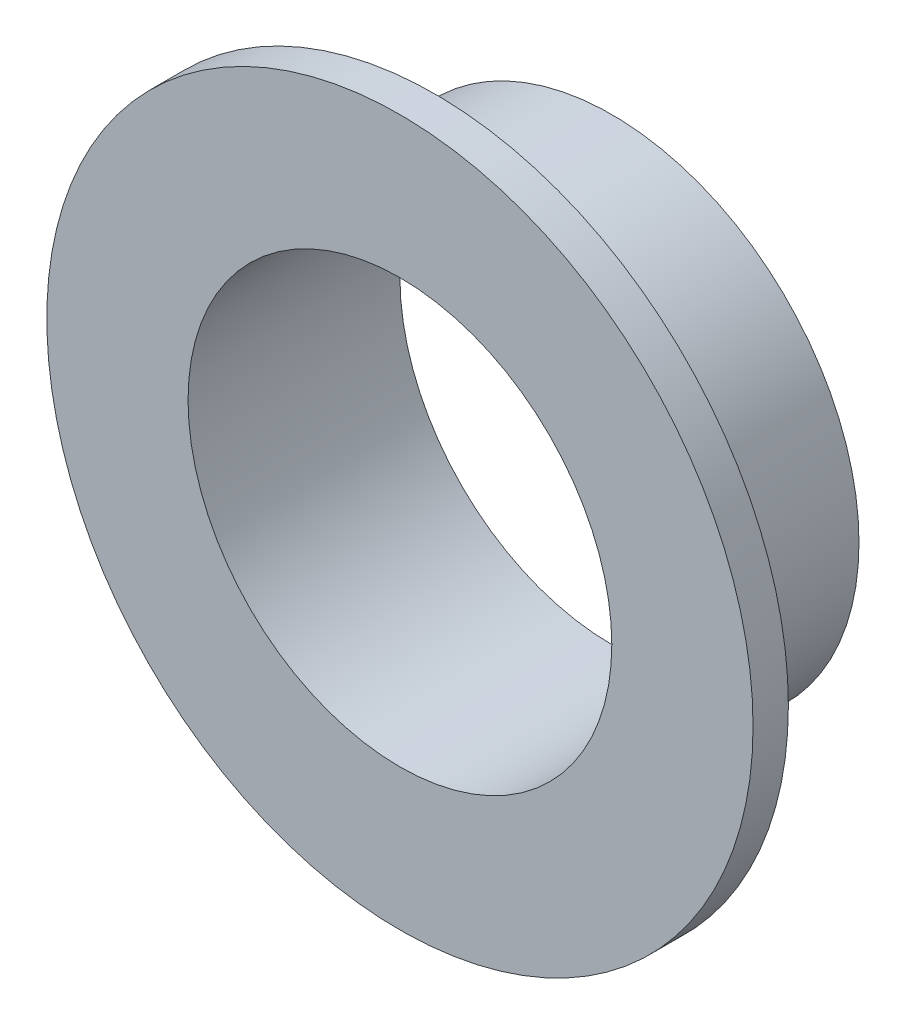
ISO-10303-21;
HEADER;
FILE_DESCRIPTION(('STEP AP214'),'2;1');
FILE_NAME('part.step','',(''),(''),'','','');
FILE_SCHEMA(('AUTOMOTIVE_DESIGN { 1 0 10303 214 1 1 1 1 }'));
ENDSEC;
DATA;
#1=APPLICATION_CONTEXT('core data for automotive mechanical design processes');
#2=APPLICATION_PROTOCOL_DEFINITION('international standard','automotive_design',2000,#1);
#3=PRODUCT_CONTEXT('',#1,'mechanical');
#4=PRODUCT('Part','Part','',(#3));
#5=PRODUCT_RELATED_PRODUCT_CATEGORY('part','',(#4));
#6=PRODUCT_DEFINITION_FORMATION('','',#4);
#7=PRODUCT_DEFINITION_CONTEXT('part definition',#1,'design');
#8=PRODUCT_DEFINITION('design','',#6,#7);
#9=PRODUCT_DEFINITION_SHAPE('','',#8);
#10=(LENGTH_UNIT() NAMED_UNIT(*) SI_UNIT(.MILLI.,.METRE.));
#11=(NAMED_UNIT(*) PLANE_ANGLE_UNIT() SI_UNIT($,.RADIAN.));
#12=(NAMED_UNIT(*) SI_UNIT($,.STERADIAN.) SOLID_ANGLE_UNIT());
#13=UNCERTAINTY_MEASURE_WITH_UNIT(LENGTH_MEASURE(1.E-05),#10,'distance_accuracy_value','');
#14=(GEOMETRIC_REPRESENTATION_CONTEXT(3) GLOBAL_UNCERTAINTY_ASSIGNED_CONTEXT((#13)) GLOBAL_UNIT_ASSIGNED_CONTEXT((#10,
#11,#12)) REPRESENTATION_CONTEXT('',''));
#15=CARTESIAN_POINT('',(0.,0.,0.));
#16=DIRECTION('',(0.,0.,1.));
#17=DIRECTION('',(1.,0.,0.));
#18=AXIS2_PLACEMENT_3D('',#15,#16,#17);
#19=CARTESIAN_POINT('',(0.,0.,0.));
#20=DIRECTION('',(0.,0.,1.));
#21=DIRECTION('',(1.,0.,0.));
#22=AXIS2_PLACEMENT_3D('',#19,#20,#21);
#23=PLANE('',#22);
#24=CARTESIAN_POINT('',(0.,0.,0.));
#25=DIRECTION('',(0.,0.,1.));
#26=DIRECTION('',(1.,0.,0.));
#27=AXIS2_PLACEMENT_3D('',#24,#25,#26);
#28=CIRCLE('',#27,7.);
#29=CARTESIAN_POINT('',(7.,0.,0.));
#30=VERTEX_POINT('',#29);
#31=EDGE_CURVE('E41',#30,#30,#28,.T.);
#32=ORIENTED_EDGE('',*,*,#31,.F.);
#33=EDGE_LOOP('',(#32));
#34=FACE_BOUND('',#33,.T.);
#35=CARTESIAN_POINT('',(0.,0.,0.));
#36=DIRECTION('',(0.,0.,1.));
#37=DIRECTION('',(1.,0.,0.));
#38=AXIS2_PLACEMENT_3D('',#35,#36,#37);
#39=CIRCLE('',#38,6.);
#40=CARTESIAN_POINT('',(6.,0.,0.));
#41=VERTEX_POINT('',#40);
#42=EDGE_CURVE('E48',#41,#41,#39,.T.);
#43=ORIENTED_EDGE('',*,*,#42,.T.);
#44=EDGE_LOOP('',(#43));
#45=FACE_BOUND('',#44,.T.);
#46=ADVANCED_FACE('F40',(#34,#45),#23,.F.);
#47=CARTESIAN_POINT('',(0.,0.,5.));
#48=DIRECTION('',(0.,0.,-1.));
#49=DIRECTION('',(-1.,0.,0.));
#50=AXIS2_PLACEMENT_3D('',#47,#48,#49);
#51=CYLINDRICAL_SURFACE('',#50,7.);
#52=CARTESIAN_POINT('',(0.,0.,5.));
#53=DIRECTION('',(0.,0.,1.));
#54=DIRECTION('',(1.,0.,0.));
#55=AXIS2_PLACEMENT_3D('',#52,#53,#54);
#56=CIRCLE('',#55,7.);
#57=CARTESIAN_POINT('',(7.,0.,5.));
#58=VERTEX_POINT('',#57);
#59=EDGE_CURVE('E10',#58,#58,#56,.T.);
#60=ORIENTED_EDGE('',*,*,#59,.F.);
#61=EDGE_LOOP('',(#60));
#62=FACE_BOUND('',#61,.T.);
#63=ORIENTED_EDGE('',*,*,#31,.T.);
#64=EDGE_LOOP('',(#63));
#65=FACE_BOUND('',#64,.T.);
#66=ADVANCED_FACE('F39',(#62,#65),#51,.T.);
#67=CARTESIAN_POINT('',(0.,0.,5.));
#68=DIRECTION('',(0.,0.,-1.));
#69=DIRECTION('',(-1.,0.,0.));
#70=AXIS2_PLACEMENT_3D('',#67,#68,#69);
#71=CYLINDRICAL_SURFACE('',#70,6.);
#72=ORIENTED_EDGE('',*,*,#42,.F.);
#73=EDGE_LOOP('',(#72));
#74=FACE_BOUND('',#73,.T.);
#75=CARTESIAN_POINT('',(0.,0.,6.));
#76=DIRECTION('',(0.,0.,1.));
#77=DIRECTION('',(1.,0.,0.));
#78=AXIS2_PLACEMENT_3D('',#75,#76,#77);
#79=CIRCLE('',#78,6.);
#80=CARTESIAN_POINT('',(6.,0.,6.));
#81=VERTEX_POINT('',#80);
#82=EDGE_CURVE('E57',#81,#81,#79,.T.);
#83=ORIENTED_EDGE('',*,*,#82,.T.);
#84=EDGE_LOOP('',(#83));
#85=FACE_BOUND('',#84,.T.);
#86=ADVANCED_FACE('F64',(#74,#85),#71,.F.);
#87=CARTESIAN_POINT('',(0.,0.,6.));
#88=DIRECTION('',(0.,0.,1.));
#89=DIRECTION('',(1.,0.,0.));
#90=AXIS2_PLACEMENT_3D('',#87,#88,#89);
#91=PLANE('',#90);
#92=CARTESIAN_POINT('',(0.,0.,6.));
#93=DIRECTION('',(0.,0.,1.));
#94=DIRECTION('',(1.,0.,0.));
#95=AXIS2_PLACEMENT_3D('',#92,#93,#94);
#96=CIRCLE('',#95,10.);
#97=CARTESIAN_POINT('',(10.,0.,6.));
#98=VERTEX_POINT('',#97);
#99=EDGE_CURVE('E55',#98,#98,#96,.T.);
#100=ORIENTED_EDGE('',*,*,#99,.T.);
#101=EDGE_LOOP('',(#100));
#102=FACE_BOUND('',#101,.T.);
#103=ORIENTED_EDGE('',*,*,#82,.F.);
#104=EDGE_LOOP('',(#103));
#105=FACE_BOUND('',#104,.T.);
#106=ADVANCED_FACE('F65',(#102,#105),#91,.T.);
#107=CARTESIAN_POINT('',(0.,0.,5.));
#108=DIRECTION('',(0.,0.,1.));
#109=DIRECTION('',(1.,0.,0.));
#110=AXIS2_PLACEMENT_3D('',#107,#108,#109);
#111=PLANE('',#110);
#112=ORIENTED_EDGE('',*,*,#59,.T.);
#113=EDGE_LOOP('',(#112));
#114=FACE_BOUND('',#113,.T.);
#115=CARTESIAN_POINT('',(0.,0.,5.));
#116=DIRECTION('',(0.,0.,1.));
#117=DIRECTION('',(1.,0.,0.));
#118=AXIS2_PLACEMENT_3D('',#115,#116,#117);
#119=CIRCLE('',#118,10.);
#120=CARTESIAN_POINT('',(10.,0.,5.));
#121=VERTEX_POINT('',#120);
#122=EDGE_CURVE('E52',#121,#121,#119,.T.);
#123=ORIENTED_EDGE('',*,*,#122,.F.);
#124=EDGE_LOOP('',(#123));
#125=FACE_BOUND('',#124,.T.);
#126=ADVANCED_FACE('F66',(#114,#125),#111,.F.);
#127=CARTESIAN_POINT('',(0.,0.,6.));
#128=DIRECTION('',(0.,0.,-1.));
#129=DIRECTION('',(-1.,0.,0.));
#130=AXIS2_PLACEMENT_3D('',#127,#128,#129);
#131=CYLINDRICAL_SURFACE('',#130,10.);
#132=ORIENTED_EDGE('',*,*,#99,.F.);
#133=EDGE_LOOP('',(#132));
#134=FACE_BOUND('',#133,.T.);
#135=ORIENTED_EDGE('',*,*,#122,.T.);
#136=EDGE_LOOP('',(#135));
#137=FACE_BOUND('',#136,.T.);
#138=ADVANCED_FACE('F71',(#134,#137),#131,.T.);
#139=CLOSED_SHELL('',(#46,#66,#86,#106,#126,#138));
#140=MANIFOLD_SOLID_BREP('B2',#139);
#141=ADVANCED_BREP_SHAPE_REPRESENTATION('',(#18,#140),#14);
#142=SHAPE_DEFINITION_REPRESENTATION(#9,#141);
ENDSEC;
END-ISO-10303-21;
